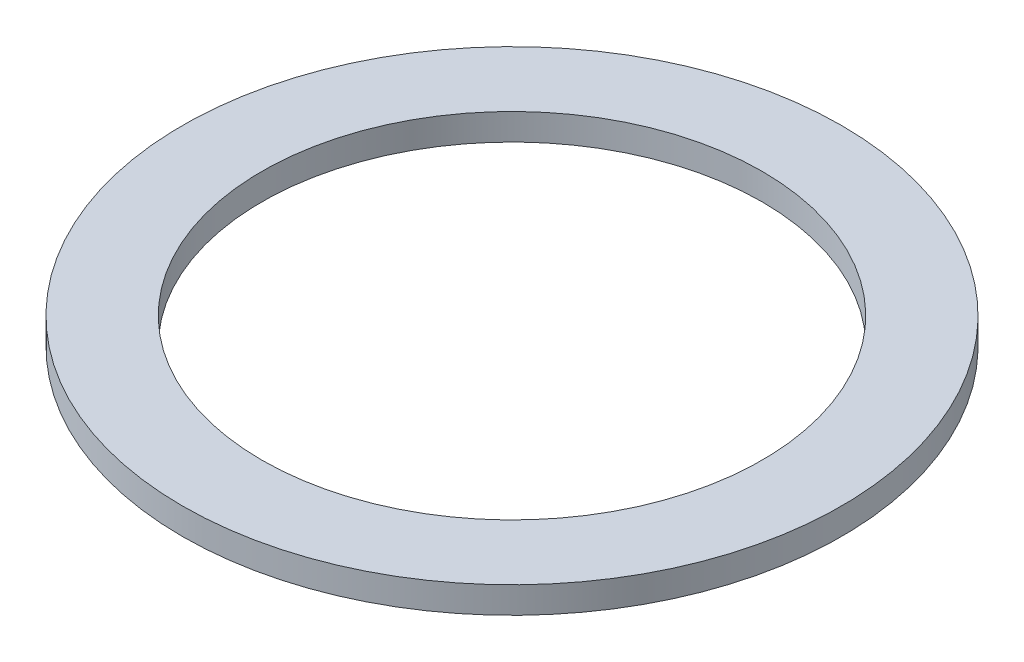
ISO-10303-21;
HEADER;
FILE_DESCRIPTION(('STEP AP214'),'2;1');
FILE_NAME('part.step','',(''),(''),'','','');
FILE_SCHEMA(('AUTOMOTIVE_DESIGN { 1 0 10303 214 1 1 1 1 }'));
ENDSEC;
DATA;
#1=APPLICATION_CONTEXT('core data for automotive mechanical design processes');
#2=APPLICATION_PROTOCOL_DEFINITION('international standard','automotive_design',2000,#1);
#3=PRODUCT_CONTEXT('',#1,'mechanical');
#4=PRODUCT('Part','Part','',(#3));
#5=PRODUCT_RELATED_PRODUCT_CATEGORY('part','',(#4));
#6=PRODUCT_DEFINITION_FORMATION('','',#4);
#7=PRODUCT_DEFINITION_CONTEXT('part definition',#1,'design');
#8=PRODUCT_DEFINITION('design','',#6,#7);
#9=PRODUCT_DEFINITION_SHAPE('','',#8);
#10=(LENGTH_UNIT() NAMED_UNIT(*) SI_UNIT(.MILLI.,.METRE.));
#11=(NAMED_UNIT(*) PLANE_ANGLE_UNIT() SI_UNIT($,.RADIAN.));
#12=(NAMED_UNIT(*) SI_UNIT($,.STERADIAN.) SOLID_ANGLE_UNIT());
#13=UNCERTAINTY_MEASURE_WITH_UNIT(LENGTH_MEASURE(1.E-05),#10,'distance_accuracy_value','');
#14=(GEOMETRIC_REPRESENTATION_CONTEXT(3) GLOBAL_UNCERTAINTY_ASSIGNED_CONTEXT((#13)) GLOBAL_UNIT_ASSIGNED_CONTEXT((#10,
#11,#12)) REPRESENTATION_CONTEXT('',''));
#15=CARTESIAN_POINT('',(0.,0.,0.));
#16=DIRECTION('',(0.,0.,1.));
#17=DIRECTION('',(1.,0.,0.));
#18=AXIS2_PLACEMENT_3D('',#15,#16,#17);
#19=CARTESIAN_POINT('',(0.,0.508,0.));
#20=DIRECTION('',(0.,-1.,0.));
#21=DIRECTION('',(0.,0.,-1.));
#22=AXIS2_PLACEMENT_3D('',#19,#20,#21);
#23=CYLINDRICAL_SURFACE('',#22,6.3246);
#24=CARTESIAN_POINT('',(0.,0.508,0.));
#25=DIRECTION('',(0.,1.,0.));
#26=DIRECTION('',(0.,0.,1.));
#27=AXIS2_PLACEMENT_3D('',#24,#25,#26);
#28=CIRCLE('',#27,6.3246);
#29=CARTESIAN_POINT('',(0.,0.508,6.3246));
#30=VERTEX_POINT('',#29);
#31=EDGE_CURVE('E10',#30,#30,#28,.T.);
#32=ORIENTED_EDGE('',*,*,#31,.F.);
#33=EDGE_LOOP('',(#32));
#34=FACE_BOUND('',#33,.T.);
#35=CARTESIAN_POINT('',(0.,0.,0.));
#36=DIRECTION('',(0.,1.,0.));
#37=DIRECTION('',(0.,0.,1.));
#38=AXIS2_PLACEMENT_3D('',#35,#36,#37);
#39=CIRCLE('',#38,6.3246);
#40=CARTESIAN_POINT('',(0.,0.,6.3246));
#41=VERTEX_POINT('',#40);
#42=EDGE_CURVE('E33',#41,#41,#39,.T.);
#43=ORIENTED_EDGE('',*,*,#42,.T.);
#44=EDGE_LOOP('',(#43));
#45=FACE_BOUND('',#44,.T.);
#46=ADVANCED_FACE('F30',(#34,#45),#23,.T.);
#47=CARTESIAN_POINT('',(0.,0.508,0.));
#48=DIRECTION('',(0.,1.,0.));
#49=DIRECTION('',(0.,0.,1.));
#50=AXIS2_PLACEMENT_3D('',#47,#48,#49);
#51=PLANE('',#50);
#52=CARTESIAN_POINT('',(0.,0.508,0.));
#53=DIRECTION('',(0.,1.,0.));
#54=DIRECTION('',(0.,0.,1.));
#55=AXIS2_PLACEMENT_3D('',#52,#53,#54);
#56=CIRCLE('',#55,4.8006);
#57=CARTESIAN_POINT('',(0.,0.508,4.8006));
#58=VERTEX_POINT('',#57);
#59=EDGE_CURVE('E42',#58,#58,#56,.T.);
#60=ORIENTED_EDGE('',*,*,#59,.F.);
#61=EDGE_LOOP('',(#60));
#62=FACE_BOUND('',#61,.T.);
#63=ORIENTED_EDGE('',*,*,#31,.T.);
#64=EDGE_LOOP('',(#63));
#65=FACE_BOUND('',#64,.T.);
#66=ADVANCED_FACE('F57',(#62,#65),#51,.T.);
#67=CARTESIAN_POINT('',(0.,0.,0.));
#68=DIRECTION('',(0.,1.,0.));
#69=DIRECTION('',(0.,0.,1.));
#70=AXIS2_PLACEMENT_3D('',#67,#68,#69);
#71=PLANE('',#70);
#72=CARTESIAN_POINT('',(0.,0.,0.));
#73=DIRECTION('',(0.,1.,0.));
#74=DIRECTION('',(0.,0.,1.));
#75=AXIS2_PLACEMENT_3D('',#72,#73,#74);
#76=CIRCLE('',#75,4.8006);
#77=CARTESIAN_POINT('',(0.,0.,4.8006));
#78=VERTEX_POINT('',#77);
#79=EDGE_CURVE('E40',#78,#78,#76,.T.);
#80=ORIENTED_EDGE('',*,*,#79,.T.);
#81=EDGE_LOOP('',(#80));
#82=FACE_BOUND('',#81,.T.);
#83=ORIENTED_EDGE('',*,*,#42,.F.);
#84=EDGE_LOOP('',(#83));
#85=FACE_BOUND('',#84,.T.);
#86=ADVANCED_FACE('F48',(#82,#85),#71,.F.);
#87=CARTESIAN_POINT('',(0.,0.,0.));
#88=DIRECTION('',(0.,1.,0.));
#89=DIRECTION('',(0.,0.,1.));
#90=AXIS2_PLACEMENT_3D('',#87,#88,#89);
#91=CYLINDRICAL_SURFACE('',#90,4.8006);
#92=ORIENTED_EDGE('',*,*,#79,.F.);
#93=EDGE_LOOP('',(#92));
#94=FACE_BOUND('',#93,.T.);
#95=ORIENTED_EDGE('',*,*,#59,.T.);
#96=EDGE_LOOP('',(#95));
#97=FACE_BOUND('',#96,.T.);
#98=ADVANCED_FACE('F51',(#94,#97),#91,.F.);
#99=CLOSED_SHELL('',(#46,#66,#86,#98));
#100=MANIFOLD_SOLID_BREP('B2',#99);
#101=ADVANCED_BREP_SHAPE_REPRESENTATION('',(#18,#100),#14);
#102=SHAPE_DEFINITION_REPRESENTATION(#9,#101);
ENDSEC;
END-ISO-10303-21;
